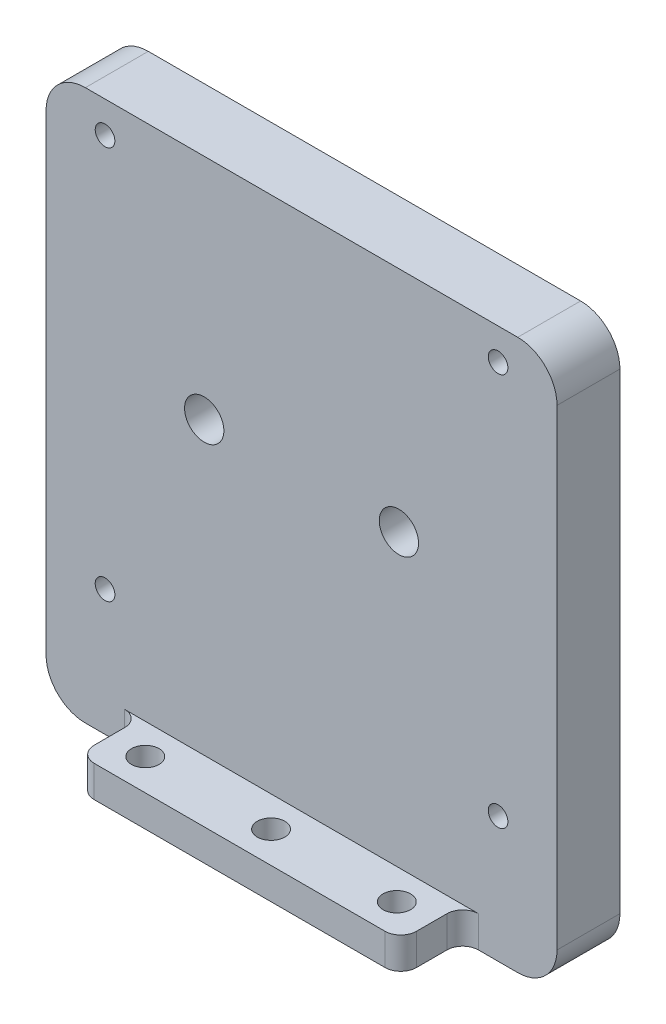
ISO-10303-21;
HEADER;
FILE_DESCRIPTION(('STEP AP214'),'2;1');
FILE_NAME('part.step','',(''),(''),'','','');
FILE_SCHEMA(('AUTOMOTIVE_DESIGN { 1 0 10303 214 1 1 1 1 }'));
ENDSEC;
DATA;
#1=APPLICATION_CONTEXT('core data for automotive mechanical design processes');
#2=APPLICATION_PROTOCOL_DEFINITION('international standard','automotive_design',2000,#1);
#3=PRODUCT_CONTEXT('',#1,'mechanical');
#4=PRODUCT('Part','Part','',(#3));
#5=PRODUCT_RELATED_PRODUCT_CATEGORY('part','',(#4));
#6=PRODUCT_DEFINITION_FORMATION('','',#4);
#7=PRODUCT_DEFINITION_CONTEXT('part definition',#1,'design');
#8=PRODUCT_DEFINITION('design','',#6,#7);
#9=PRODUCT_DEFINITION_SHAPE('','',#8);
#10=(LENGTH_UNIT() NAMED_UNIT(*) SI_UNIT(.MILLI.,.METRE.));
#11=(NAMED_UNIT(*) PLANE_ANGLE_UNIT() SI_UNIT($,.RADIAN.));
#12=(NAMED_UNIT(*) SI_UNIT($,.STERADIAN.) SOLID_ANGLE_UNIT());
#13=UNCERTAINTY_MEASURE_WITH_UNIT(LENGTH_MEASURE(1.E-05),#10,'distance_accuracy_value','');
#14=(GEOMETRIC_REPRESENTATION_CONTEXT(3) GLOBAL_UNCERTAINTY_ASSIGNED_CONTEXT((#13)) GLOBAL_UNIT_ASSIGNED_CONTEXT((#10,
#11,#12)) REPRESENTATION_CONTEXT('',''));
#15=CARTESIAN_POINT('',(0.,0.,0.));
#16=DIRECTION('',(0.,0.,1.));
#17=DIRECTION('',(1.,0.,0.));
#18=AXIS2_PLACEMENT_3D('',#15,#16,#17);
#19=CARTESIAN_POINT('',(0.,0.,0.));
#20=DIRECTION('',(0.,0.,1.));
#21=DIRECTION('',(1.,0.,0.));
#22=AXIS2_PLACEMENT_3D('',#19,#20,#21);
#23=PLANE('',#22);
#24=CARTESIAN_POINT('',(12.3825,6.00000000000001,0.));
#25=DIRECTION('',(0.,0.,-1.));
#26=DIRECTION('',(-1.,0.,0.));
#27=AXIS2_PLACEMENT_3D('',#24,#25,#26);
#28=CIRCLE('',#27,2.5);
#29=CARTESIAN_POINT('',(9.8825,6.00000000000001,0.));
#30=VERTEX_POINT('',#29);
#31=EDGE_CURVE('E339',#30,#30,#28,.T.);
#32=ORIENTED_EDGE('',*,*,#31,.F.);
#33=EDGE_LOOP('',(#32));
#34=FACE_BOUND('',#33,.T.);
#35=CARTESIAN_POINT('',(-12.3825,6.00000000000001,0.));
#36=DIRECTION('',(0.,0.,-1.));
#37=DIRECTION('',(-1.,0.,0.));
#38=AXIS2_PLACEMENT_3D('',#35,#36,#37);
#39=CIRCLE('',#38,2.5);
#40=CARTESIAN_POINT('',(-14.8825,6.00000000000001,0.));
#41=VERTEX_POINT('',#40);
#42=EDGE_CURVE('E325',#41,#41,#39,.T.);
#43=ORIENTED_EDGE('',*,*,#42,.F.);
#44=EDGE_LOOP('',(#43));
#45=FACE_BOUND('',#44,.T.);
#46=CARTESIAN_POINT('',(25.,-19.,0.));
#47=DIRECTION('',(0.,0.,-1.));
#48=DIRECTION('',(-1.,0.,0.));
#49=AXIS2_PLACEMENT_3D('',#46,#47,#48);
#50=CIRCLE('',#49,1.25);
#51=CARTESIAN_POINT('',(23.75,-19.,0.));
#52=VERTEX_POINT('',#51);
#53=EDGE_CURVE('E324',#52,#52,#50,.T.);
#54=ORIENTED_EDGE('',*,*,#53,.F.);
#55=EDGE_LOOP('',(#54));
#56=FACE_BOUND('',#55,.T.);
#57=CARTESIAN_POINT('',(25.,31.,0.));
#58=DIRECTION('',(0.,0.,-1.));
#59=DIRECTION('',(-1.,0.,0.));
#60=AXIS2_PLACEMENT_3D('',#57,#58,#59);
#61=CIRCLE('',#60,1.25);
#62=CARTESIAN_POINT('',(23.75,31.,0.));
#63=VERTEX_POINT('',#62);
#64=EDGE_CURVE('E320',#63,#63,#61,.T.);
#65=ORIENTED_EDGE('',*,*,#64,.F.);
#66=EDGE_LOOP('',(#65));
#67=FACE_BOUND('',#66,.T.);
#68=CARTESIAN_POINT('',(-25.,31.,0.));
#69=DIRECTION('',(0.,0.,-1.));
#70=DIRECTION('',(-1.,0.,0.));
#71=AXIS2_PLACEMENT_3D('',#68,#69,#70);
#72=CIRCLE('',#71,1.25);
#73=CARTESIAN_POINT('',(-26.25,31.,0.));
#74=VERTEX_POINT('',#73);
#75=EDGE_CURVE('E316',#74,#74,#72,.T.);
#76=ORIENTED_EDGE('',*,*,#75,.F.);
#77=EDGE_LOOP('',(#76));
#78=FACE_BOUND('',#77,.T.);
#79=DIRECTION('',(0.,1.,0.));
#80=VECTOR('',#79,1.);
#81=CARTESIAN_POINT('',(32.5,35.,0.));
#82=LINE('',#81,#80);
#83=CARTESIAN_POINT('',(32.5,-30.,0.));
#84=VERTEX_POINT('',#83);
#85=CARTESIAN_POINT('',(32.5,30.,0.));
#86=VERTEX_POINT('',#85);
#87=EDGE_CURVE('E178',#84,#86,#82,.T.);
#88=ORIENTED_EDGE('',*,*,#87,.F.);
#89=CARTESIAN_POINT('',(27.5,-30.,0.));
#90=DIRECTION('',(0.,0.,1.));
#91=DIRECTION('',(1.,0.,0.));
#92=AXIS2_PLACEMENT_3D('',#89,#90,#91);
#93=CIRCLE('',#92,5.);
#94=CARTESIAN_POINT('',(27.5,-35.,0.));
#95=VERTEX_POINT('',#94);
#96=EDGE_CURVE('E159',#84,#95,#93,.F.);
#97=ORIENTED_EDGE('',*,*,#96,.T.);
#98=DIRECTION('',(1.,0.,0.));
#99=VECTOR('',#98,1.);
#100=CARTESIAN_POINT('',(-32.5,-35.,0.));
#101=LINE('',#100,#99);
#102=CARTESIAN_POINT('',(-27.5,-35.,0.));
#103=VERTEX_POINT('',#102);
#104=EDGE_CURVE('E207',#103,#95,#101,.T.);
#105=ORIENTED_EDGE('',*,*,#104,.F.);
#106=CARTESIAN_POINT('',(-27.5,-30.,0.));
#107=DIRECTION('',(0.,0.,1.));
#108=DIRECTION('',(1.,0.,0.));
#109=AXIS2_PLACEMENT_3D('',#106,#107,#108);
#110=CIRCLE('',#109,5.);
#111=CARTESIAN_POINT('',(-32.5,-30.,0.));
#112=VERTEX_POINT('',#111);
#113=EDGE_CURVE('E172',#103,#112,#110,.F.);
#114=ORIENTED_EDGE('',*,*,#113,.T.);
#115=DIRECTION('',(0.,-1.,0.));
#116=VECTOR('',#115,1.);
#117=CARTESIAN_POINT('',(-32.5,35.,0.));
#118=LINE('',#117,#116);
#119=CARTESIAN_POINT('',(-32.5,30.,0.));
#120=VERTEX_POINT('',#119);
#121=EDGE_CURVE('E196',#120,#112,#118,.T.);
#122=ORIENTED_EDGE('',*,*,#121,.F.);
#123=CARTESIAN_POINT('',(-27.5,30.,0.));
#124=DIRECTION('',(0.,0.,1.));
#125=DIRECTION('',(1.,0.,0.));
#126=AXIS2_PLACEMENT_3D('',#123,#124,#125);
#127=CIRCLE('',#126,5.);
#128=CARTESIAN_POINT('',(-27.5,35.,0.));
#129=VERTEX_POINT('',#128);
#130=EDGE_CURVE('E183',#120,#129,#127,.F.);
#131=ORIENTED_EDGE('',*,*,#130,.T.);
#132=DIRECTION('',(-1.,0.,0.));
#133=VECTOR('',#132,1.);
#134=CARTESIAN_POINT('',(-32.5,35.,0.));
#135=LINE('',#134,#133);
#136=CARTESIAN_POINT('',(27.5,35.,0.));
#137=VERTEX_POINT('',#136);
#138=EDGE_CURVE('E190',#137,#129,#135,.T.);
#139=ORIENTED_EDGE('',*,*,#138,.F.);
#140=CARTESIAN_POINT('',(27.5,30.,0.));
#141=DIRECTION('',(0.,0.,1.));
#142=DIRECTION('',(1.,0.,0.));
#143=AXIS2_PLACEMENT_3D('',#140,#141,#142);
#144=CIRCLE('',#143,5.);
#145=EDGE_CURVE('E188',#137,#86,#144,.F.);
#146=ORIENTED_EDGE('',*,*,#145,.T.);
#147=EDGE_LOOP('',(#88,#97,#105,#114,#122,#131,#139,#146));
#148=FACE_BOUND('',#147,.T.);
#149=CARTESIAN_POINT('',(-25.,-19.,0.));
#150=DIRECTION('',(0.,0.,-1.));
#151=DIRECTION('',(-1.,0.,0.));
#152=AXIS2_PLACEMENT_3D('',#149,#150,#151);
#153=CIRCLE('',#152,1.25);
#154=CARTESIAN_POINT('',(-26.25,-19.,0.));
#155=VERTEX_POINT('',#154);
#156=EDGE_CURVE('E315',#155,#155,#153,.T.);
#157=ORIENTED_EDGE('',*,*,#156,.F.);
#158=EDGE_LOOP('',(#157));
#159=FACE_BOUND('',#158,.T.);
#160=ADVANCED_FACE('F43',(#34,#45,#56,#67,#78,#148,#159),#23,.F.);
#161=CARTESIAN_POINT('',(32.5,35.,8.));
#162=DIRECTION('',(-1.,0.,0.));
#163=DIRECTION('',(0.,-1.,0.));
#164=AXIS2_PLACEMENT_3D('',#161,#162,#163);
#165=PLANE('',#164);
#166=DIRECTION('',(0.,1.,0.));
#167=VECTOR('',#166,1.);
#168=CARTESIAN_POINT('',(32.5,35.,8.));
#169=LINE('',#168,#167);
#170=CARTESIAN_POINT('',(32.5,-30.,8.));
#171=VERTEX_POINT('',#170);
#172=CARTESIAN_POINT('',(32.5,30.,8.));
#173=VERTEX_POINT('',#172);
#174=EDGE_CURVE('E181',#171,#173,#169,.T.);
#175=ORIENTED_EDGE('',*,*,#174,.F.);
#176=DIRECTION('',(0.,0.,-1.));
#177=VECTOR('',#176,1.);
#178=CARTESIAN_POINT('',(32.5,-30.,8.));
#179=LINE('',#178,#177);
#180=EDGE_CURVE('E163',#171,#84,#179,.T.);
#181=ORIENTED_EDGE('',*,*,#180,.T.);
#182=ORIENTED_EDGE('',*,*,#87,.T.);
#183=DIRECTION('',(0.,0.,-1.));
#184=VECTOR('',#183,1.);
#185=CARTESIAN_POINT('',(32.5,30.,8.));
#186=LINE('',#185,#184);
#187=EDGE_CURVE('E184',#86,#173,#186,.F.);
#188=ORIENTED_EDGE('',*,*,#187,.T.);
#189=EDGE_LOOP('',(#175,#181,#182,#188));
#190=FACE_BOUND('',#189,.T.);
#191=ADVANCED_FACE('F177',(#190),#165,.F.);
#192=CARTESIAN_POINT('',(-32.5,35.,8.));
#193=DIRECTION('',(0.,-1.,0.));
#194=DIRECTION('',(0.,0.,-1.));
#195=AXIS2_PLACEMENT_3D('',#192,#193,#194);
#196=PLANE('',#195);
#197=DIRECTION('',(-1.,0.,0.));
#198=VECTOR('',#197,1.);
#199=CARTESIAN_POINT('',(-32.5,35.,8.));
#200=LINE('',#199,#198);
#201=CARTESIAN_POINT('',(27.5,35.,8.));
#202=VERTEX_POINT('',#201);
#203=CARTESIAN_POINT('',(-27.5,35.,8.));
#204=VERTEX_POINT('',#203);
#205=EDGE_CURVE('E392',#202,#204,#200,.T.);
#206=ORIENTED_EDGE('',*,*,#205,.F.);
#207=DIRECTION('',(0.,0.,-1.));
#208=VECTOR('',#207,1.);
#209=CARTESIAN_POINT('',(27.5,35.,8.));
#210=LINE('',#209,#208);
#211=EDGE_CURVE('E245',#202,#137,#210,.T.);
#212=ORIENTED_EDGE('',*,*,#211,.T.);
#213=ORIENTED_EDGE('',*,*,#138,.T.);
#214=DIRECTION('',(0.,0.,-1.));
#215=VECTOR('',#214,1.);
#216=CARTESIAN_POINT('',(-27.5,35.,8.));
#217=LINE('',#216,#215);
#218=EDGE_CURVE('E242',#129,#204,#217,.F.);
#219=ORIENTED_EDGE('',*,*,#218,.T.);
#220=EDGE_LOOP('',(#206,#212,#213,#219));
#221=FACE_BOUND('',#220,.T.);
#222=ADVANCED_FACE('F444',(#221),#196,.F.);
#223=CARTESIAN_POINT('',(-32.5,35.,8.));
#224=DIRECTION('',(1.,0.,0.));
#225=DIRECTION('',(0.,1.,0.));
#226=AXIS2_PLACEMENT_3D('',#223,#224,#225);
#227=PLANE('',#226);
#228=ORIENTED_EDGE('',*,*,#121,.T.);
#229=DIRECTION('',(0.,0.,-1.));
#230=VECTOR('',#229,1.);
#231=CARTESIAN_POINT('',(-32.5,-30.,8.));
#232=LINE('',#231,#230);
#233=CARTESIAN_POINT('',(-32.5,-30.,8.));
#234=VERTEX_POINT('',#233);
#235=EDGE_CURVE('E239',#112,#234,#232,.F.);
#236=ORIENTED_EDGE('',*,*,#235,.T.);
#237=DIRECTION('',(0.,-1.,0.));
#238=VECTOR('',#237,1.);
#239=CARTESIAN_POINT('',(-32.5,35.,8.));
#240=LINE('',#239,#238);
#241=CARTESIAN_POINT('',(-32.5,30.,8.));
#242=VERTEX_POINT('',#241);
#243=EDGE_CURVE('E395',#242,#234,#240,.T.);
#244=ORIENTED_EDGE('',*,*,#243,.F.);
#245=DIRECTION('',(0.,0.,-1.));
#246=VECTOR('',#245,1.);
#247=CARTESIAN_POINT('',(-32.5,30.,8.));
#248=LINE('',#247,#246);
#249=EDGE_CURVE('E235',#242,#120,#248,.T.);
#250=ORIENTED_EDGE('',*,*,#249,.T.);
#251=EDGE_LOOP('',(#228,#236,#244,#250));
#252=FACE_BOUND('',#251,.T.);
#253=ADVANCED_FACE('F452',(#252),#227,.F.);
#254=CARTESIAN_POINT('',(-32.5,-35.,8.));
#255=DIRECTION('',(0.,1.,0.));
#256=DIRECTION('',(0.,0.,1.));
#257=AXIS2_PLACEMENT_3D('',#254,#255,#256);
#258=PLANE('',#257);
#259=CARTESIAN_POINT('',(16.,-35.,11.8798952798945));
#260=DIRECTION('',(0.,-1.,0.));
#261=DIRECTION('',(0.,0.,-1.));
#262=AXIS2_PLACEMENT_3D('',#259,#260,#261);
#263=CIRCLE('',#262,1.75);
#264=CARTESIAN_POINT('',(16.,-35.,10.1298952798945));
#265=VERTEX_POINT('',#264);
#266=EDGE_CURVE('E358',#265,#265,#263,.T.);
#267=ORIENTED_EDGE('',*,*,#266,.F.);
#268=EDGE_LOOP('',(#267));
#269=FACE_BOUND('',#268,.T.);
#270=CARTESIAN_POINT('',(-16.,-35.,11.8798952798945));
#271=DIRECTION('',(0.,-1.,0.));
#272=DIRECTION('',(0.,0.,-1.));
#273=AXIS2_PLACEMENT_3D('',#270,#271,#272);
#274=CIRCLE('',#273,1.75);
#275=CARTESIAN_POINT('',(-16.,-35.,10.1298952798945));
#276=VERTEX_POINT('',#275);
#277=EDGE_CURVE('E359',#276,#276,#274,.T.);
#278=ORIENTED_EDGE('',*,*,#277,.F.);
#279=EDGE_LOOP('',(#278));
#280=FACE_BOUND('',#279,.T.);
#281=CARTESIAN_POINT('',(0.,-35.,11.8798952798945));
#282=DIRECTION('',(0.,-1.,0.));
#283=DIRECTION('',(0.,0.,-1.));
#284=AXIS2_PLACEMENT_3D('',#281,#282,#283);
#285=CIRCLE('',#284,1.75);
#286=CARTESIAN_POINT('',(0.,-35.,10.1298952798945));
#287=VERTEX_POINT('',#286);
#288=EDGE_CURVE('E302',#287,#287,#285,.T.);
#289=ORIENTED_EDGE('',*,*,#288,.F.);
#290=EDGE_LOOP('',(#289));
#291=FACE_BOUND('',#290,.T.);
#292=DIRECTION('',(0.,0.,-1.));
#293=VECTOR('',#292,1.);
#294=CARTESIAN_POINT('',(20.5,-35.,15.8798952798945));
#295=LINE('',#294,#293);
#296=CARTESIAN_POINT('',(20.5,-35.,13.8798952798945));
#297=VERTEX_POINT('',#296);
#298=CARTESIAN_POINT('',(20.5,-35.,10.));
#299=VERTEX_POINT('',#298);
#300=EDGE_CURVE('E198',#297,#299,#295,.T.);
#301=ORIENTED_EDGE('',*,*,#300,.F.);
#302=CARTESIAN_POINT('',(18.5,-35.,13.8798952798945));
#303=DIRECTION('',(0.,1.,0.));
#304=DIRECTION('',(0.,0.,1.));
#305=AXIS2_PLACEMENT_3D('',#302,#303,#304);
#306=CIRCLE('',#305,2.);
#307=CARTESIAN_POINT('',(18.5,-35.,15.8798952798945));
#308=VERTEX_POINT('',#307);
#309=EDGE_CURVE('E279',#297,#308,#306,.F.);
#310=ORIENTED_EDGE('',*,*,#309,.T.);
#311=DIRECTION('',(1.,0.,0.));
#312=VECTOR('',#311,1.);
#313=CARTESIAN_POINT('',(-20.5,-35.,15.8798952798945));
#314=LINE('',#313,#312);
#315=CARTESIAN_POINT('',(-18.5,-35.,15.8798952798945));
#316=VERTEX_POINT('',#315);
#317=EDGE_CURVE('E369',#316,#308,#314,.T.);
#318=ORIENTED_EDGE('',*,*,#317,.F.);
#319=CARTESIAN_POINT('',(-18.5,-35.,13.8798952798945));
#320=DIRECTION('',(0.,1.,0.));
#321=DIRECTION('',(0.,0.,1.));
#322=AXIS2_PLACEMENT_3D('',#319,#320,#321);
#323=CIRCLE('',#322,2.);
#324=CARTESIAN_POINT('',(-20.5,-35.,13.8798952798945));
#325=VERTEX_POINT('',#324);
#326=EDGE_CURVE('E68',#316,#325,#323,.F.);
#327=ORIENTED_EDGE('',*,*,#326,.T.);
#328=DIRECTION('',(0.,0.,-1.));
#329=VECTOR('',#328,1.);
#330=CARTESIAN_POINT('',(-20.5,-35.,15.8798952798945));
#331=LINE('',#330,#329);
#332=CARTESIAN_POINT('',(-20.5,-35.,10.));
#333=VERTEX_POINT('',#332);
#334=EDGE_CURVE('E191',#325,#333,#331,.T.);
#335=ORIENTED_EDGE('',*,*,#334,.T.);
#336=CARTESIAN_POINT('',(-22.5,-35.,10.));
#337=DIRECTION('',(0.,1.,0.));
#338=DIRECTION('',(0.,0.,1.));
#339=AXIS2_PLACEMENT_3D('',#336,#337,#338);
#340=CIRCLE('',#339,2.);
#341=CARTESIAN_POINT('',(-22.5,-35.,8.));
#342=VERTEX_POINT('',#341);
#343=EDGE_CURVE('E53',#333,#342,#340,.T.);
#344=ORIENTED_EDGE('',*,*,#343,.T.);
#345=DIRECTION('',(1.,0.,0.));
#346=VECTOR('',#345,1.);
#347=CARTESIAN_POINT('',(-32.5,-35.,8.));
#348=LINE('',#347,#346);
#349=CARTESIAN_POINT('',(-27.5,-35.,8.));
#350=VERTEX_POINT('',#349);
#351=EDGE_CURVE('E201',#350,#342,#348,.T.);
#352=ORIENTED_EDGE('',*,*,#351,.F.);
#353=DIRECTION('',(0.,0.,-1.));
#354=VECTOR('',#353,1.);
#355=CARTESIAN_POINT('',(-27.5,-35.,8.));
#356=LINE('',#355,#354);
#357=EDGE_CURVE('E171',#350,#103,#356,.T.);
#358=ORIENTED_EDGE('',*,*,#357,.T.);
#359=ORIENTED_EDGE('',*,*,#104,.T.);
#360=DIRECTION('',(0.,0.,-1.));
#361=VECTOR('',#360,1.);
#362=CARTESIAN_POINT('',(27.5,-35.,8.));
#363=LINE('',#362,#361);
#364=CARTESIAN_POINT('',(27.5,-35.,8.));
#365=VERTEX_POINT('',#364);
#366=EDGE_CURVE('E165',#95,#365,#363,.F.);
#367=ORIENTED_EDGE('',*,*,#366,.T.);
#368=CARTESIAN_POINT('',(22.5,-35.,8.));
#369=VERTEX_POINT('',#368);
#370=EDGE_CURVE('E398',#369,#365,#348,.T.);
#371=ORIENTED_EDGE('',*,*,#370,.F.);
#372=CARTESIAN_POINT('',(22.5,-35.,10.));
#373=DIRECTION('',(0.,1.,0.));
#374=DIRECTION('',(0.,0.,1.));
#375=AXIS2_PLACEMENT_3D('',#372,#373,#374);
#376=CIRCLE('',#375,2.);
#377=EDGE_CURVE('E292',#369,#299,#376,.T.);
#378=ORIENTED_EDGE('',*,*,#377,.T.);
#379=EDGE_LOOP('',(#301,#310,#318,#327,#335,#344,#352,#358,#359,#367,#371,#378));
#380=FACE_BOUND('',#379,.T.);
#381=ADVANCED_FACE('F437',(#269,#280,#291,#380),#258,.F.);
#382=CARTESIAN_POINT('',(0.,0.,8.));
#383=DIRECTION('',(0.,0.,1.));
#384=DIRECTION('',(1.,0.,0.));
#385=AXIS2_PLACEMENT_3D('',#382,#383,#384);
#386=PLANE('',#385);
#387=CARTESIAN_POINT('',(12.3825,6.00000000000001,8.));
#388=DIRECTION('',(0.,0.,1.));
#389=DIRECTION('',(1.,0.,0.));
#390=AXIS2_PLACEMENT_3D('',#387,#388,#389);
#391=CIRCLE('',#390,2.5);
#392=CARTESIAN_POINT('',(14.8825,6.00000000000001,8.));
#393=VERTEX_POINT('',#392);
#394=EDGE_CURVE('E47',#393,#393,#391,.T.);
#395=ORIENTED_EDGE('',*,*,#394,.F.);
#396=EDGE_LOOP('',(#395));
#397=FACE_BOUND('',#396,.T.);
#398=CARTESIAN_POINT('',(-12.3825,6.00000000000001,8.));
#399=DIRECTION('',(0.,0.,1.));
#400=DIRECTION('',(1.,0.,0.));
#401=AXIS2_PLACEMENT_3D('',#398,#399,#400);
#402=CIRCLE('',#401,2.5);
#403=CARTESIAN_POINT('',(-9.8825,6.00000000000001,8.));
#404=VERTEX_POINT('',#403);
#405=EDGE_CURVE('E321',#404,#404,#402,.T.);
#406=ORIENTED_EDGE('',*,*,#405,.F.);
#407=EDGE_LOOP('',(#406));
#408=FACE_BOUND('',#407,.T.);
#409=CARTESIAN_POINT('',(25.,-19.,8.));
#410=DIRECTION('',(0.,0.,1.));
#411=DIRECTION('',(1.,0.,0.));
#412=AXIS2_PLACEMENT_3D('',#409,#410,#411);
#413=CIRCLE('',#412,1.25);
#414=CARTESIAN_POINT('',(26.25,-19.,8.));
#415=VERTEX_POINT('',#414);
#416=EDGE_CURVE('E331',#415,#415,#413,.T.);
#417=ORIENTED_EDGE('',*,*,#416,.F.);
#418=EDGE_LOOP('',(#417));
#419=FACE_BOUND('',#418,.T.);
#420=CARTESIAN_POINT('',(25.,31.,8.));
#421=DIRECTION('',(0.,0.,1.));
#422=DIRECTION('',(1.,0.,0.));
#423=AXIS2_PLACEMENT_3D('',#420,#421,#422);
#424=CIRCLE('',#423,1.25);
#425=CARTESIAN_POINT('',(26.25,31.,8.));
#426=VERTEX_POINT('',#425);
#427=EDGE_CURVE('E317',#426,#426,#424,.T.);
#428=ORIENTED_EDGE('',*,*,#427,.F.);
#429=EDGE_LOOP('',(#428));
#430=FACE_BOUND('',#429,.T.);
#431=CARTESIAN_POINT('',(-25.,31.,8.));
#432=DIRECTION('',(0.,0.,1.));
#433=DIRECTION('',(1.,0.,0.));
#434=AXIS2_PLACEMENT_3D('',#431,#432,#433);
#435=CIRCLE('',#434,1.25);
#436=CARTESIAN_POINT('',(-23.75,31.,8.));
#437=VERTEX_POINT('',#436);
#438=EDGE_CURVE('E311',#437,#437,#435,.T.);
#439=ORIENTED_EDGE('',*,*,#438,.F.);
#440=EDGE_LOOP('',(#439));
#441=FACE_BOUND('',#440,.T.);
#442=CARTESIAN_POINT('',(-25.,-19.,8.));
#443=DIRECTION('',(0.,0.,1.));
#444=DIRECTION('',(1.,0.,0.));
#445=AXIS2_PLACEMENT_3D('',#442,#443,#444);
#446=CIRCLE('',#445,1.25);
#447=CARTESIAN_POINT('',(-23.75,-19.,8.));
#448=VERTEX_POINT('',#447);
#449=EDGE_CURVE('E354',#448,#448,#446,.T.);
#450=ORIENTED_EDGE('',*,*,#449,.F.);
#451=EDGE_LOOP('',(#450));
#452=FACE_BOUND('',#451,.T.);
#453=DIRECTION('',(-1.,0.,0.));
#454=VECTOR('',#453,1.);
#455=CARTESIAN_POINT('',(-20.5,-31.,8.));
#456=LINE('',#455,#454);
#457=CARTESIAN_POINT('',(22.5,-31.,8.));
#458=VERTEX_POINT('',#457);
#459=CARTESIAN_POINT('',(-22.5,-31.,8.));
#460=VERTEX_POINT('',#459);
#461=EDGE_CURVE('E310',#458,#460,#456,.T.);
#462=ORIENTED_EDGE('',*,*,#461,.F.);
#463=DIRECTION('',(0.,1.,0.));
#464=VECTOR('',#463,1.);
#465=CARTESIAN_POINT('',(22.4999999999995,3.12250225675819E-13,8.));
#466=LINE('',#465,#464);
#467=EDGE_CURVE('E260',#458,#369,#466,.F.);
#468=ORIENTED_EDGE('',*,*,#467,.T.);
#469=ORIENTED_EDGE('',*,*,#370,.T.);
#470=CARTESIAN_POINT('',(27.5,-30.,8.));
#471=DIRECTION('',(0.,0.,1.));
#472=DIRECTION('',(1.,0.,0.));
#473=AXIS2_PLACEMENT_3D('',#470,#471,#472);
#474=CIRCLE('',#473,5.);
#475=EDGE_CURVE('E232',#365,#171,#474,.T.);
#476=ORIENTED_EDGE('',*,*,#475,.T.);
#477=ORIENTED_EDGE('',*,*,#174,.T.);
#478=CARTESIAN_POINT('',(27.5,30.,8.));
#479=DIRECTION('',(0.,0.,1.));
#480=DIRECTION('',(1.,0.,0.));
#481=AXIS2_PLACEMENT_3D('',#478,#479,#480);
#482=CIRCLE('',#481,5.);
#483=EDGE_CURVE('E226',#173,#202,#482,.T.);
#484=ORIENTED_EDGE('',*,*,#483,.T.);
#485=ORIENTED_EDGE('',*,*,#205,.T.);
#486=CARTESIAN_POINT('',(-27.5,30.,8.));
#487=DIRECTION('',(0.,0.,1.));
#488=DIRECTION('',(1.,0.,0.));
#489=AXIS2_PLACEMENT_3D('',#486,#487,#488);
#490=CIRCLE('',#489,5.);
#491=EDGE_CURVE('E223',#204,#242,#490,.T.);
#492=ORIENTED_EDGE('',*,*,#491,.T.);
#493=ORIENTED_EDGE('',*,*,#243,.T.);
#494=CARTESIAN_POINT('',(-27.5,-30.,8.));
#495=DIRECTION('',(0.,0.,1.));
#496=DIRECTION('',(1.,0.,0.));
#497=AXIS2_PLACEMENT_3D('',#494,#495,#496);
#498=CIRCLE('',#497,5.);
#499=EDGE_CURVE('E229',#234,#350,#498,.T.);
#500=ORIENTED_EDGE('',*,*,#499,.T.);
#501=ORIENTED_EDGE('',*,*,#351,.T.);
#502=DIRECTION('',(0.,-1.,0.));
#503=VECTOR('',#502,1.);
#504=CARTESIAN_POINT('',(-22.5,0.,8.));
#505=LINE('',#504,#503);
#506=EDGE_CURVE('E256',#342,#460,#505,.F.);
#507=ORIENTED_EDGE('',*,*,#506,.T.);
#508=EDGE_LOOP('',(#462,#468,#469,#476,#477,#484,#485,#492,#493,#500,#501,#507));
#509=FACE_BOUND('',#508,.T.);
#510=ADVANCED_FACE('F407',(#397,#408,#419,#430,#441,#452,#509),#386,.T.);
#511=CARTESIAN_POINT('',(27.5,-30.,8.));
#512=DIRECTION('',(0.,0.,-1.));
#513=DIRECTION('',(-1.,0.,0.));
#514=AXIS2_PLACEMENT_3D('',#511,#512,#513);
#515=CYLINDRICAL_SURFACE('',#514,5.);
#516=ORIENTED_EDGE('',*,*,#475,.F.);
#517=ORIENTED_EDGE('',*,*,#366,.F.);
#518=ORIENTED_EDGE('',*,*,#96,.F.);
#519=ORIENTED_EDGE('',*,*,#180,.F.);
#520=EDGE_LOOP('',(#516,#517,#518,#519));
#521=FACE_BOUND('',#520,.T.);
#522=ADVANCED_FACE('F162',(#521),#515,.T.);
#523=CARTESIAN_POINT('',(-27.5,-30.,8.));
#524=DIRECTION('',(0.,0.,-1.));
#525=DIRECTION('',(-1.,0.,0.));
#526=AXIS2_PLACEMENT_3D('',#523,#524,#525);
#527=CYLINDRICAL_SURFACE('',#526,5.);
#528=ORIENTED_EDGE('',*,*,#499,.F.);
#529=ORIENTED_EDGE('',*,*,#235,.F.);
#530=ORIENTED_EDGE('',*,*,#113,.F.);
#531=ORIENTED_EDGE('',*,*,#357,.F.);
#532=EDGE_LOOP('',(#528,#529,#530,#531));
#533=FACE_BOUND('',#532,.T.);
#534=ADVANCED_FACE('F455',(#533),#527,.T.);
#535=CARTESIAN_POINT('',(27.5,30.,8.));
#536=DIRECTION('',(0.,0.,-1.));
#537=DIRECTION('',(-1.,0.,0.));
#538=AXIS2_PLACEMENT_3D('',#535,#536,#537);
#539=CYLINDRICAL_SURFACE('',#538,5.);
#540=ORIENTED_EDGE('',*,*,#483,.F.);
#541=ORIENTED_EDGE('',*,*,#187,.F.);
#542=ORIENTED_EDGE('',*,*,#145,.F.);
#543=ORIENTED_EDGE('',*,*,#211,.F.);
#544=EDGE_LOOP('',(#540,#541,#542,#543));
#545=FACE_BOUND('',#544,.T.);
#546=ADVANCED_FACE('F442',(#545),#539,.T.);
#547=CARTESIAN_POINT('',(-27.5,30.,8.));
#548=DIRECTION('',(0.,0.,-1.));
#549=DIRECTION('',(-1.,0.,0.));
#550=AXIS2_PLACEMENT_3D('',#547,#548,#549);
#551=CYLINDRICAL_SURFACE('',#550,5.);
#552=ORIENTED_EDGE('',*,*,#491,.F.);
#553=ORIENTED_EDGE('',*,*,#218,.F.);
#554=ORIENTED_EDGE('',*,*,#130,.F.);
#555=ORIENTED_EDGE('',*,*,#249,.F.);
#556=EDGE_LOOP('',(#552,#553,#554,#555));
#557=FACE_BOUND('',#556,.T.);
#558=ADVANCED_FACE('F450',(#557),#551,.T.);
#559=CARTESIAN_POINT('',(-20.5,-35.,15.8798952798945));
#560=DIRECTION('',(1.,0.,0.));
#561=DIRECTION('',(0.,0.,-1.));
#562=AXIS2_PLACEMENT_3D('',#559,#560,#561);
#563=PLANE('',#562);
#564=ORIENTED_EDGE('',*,*,#334,.F.);
#565=DIRECTION('',(0.,-1.,0.));
#566=VECTOR('',#565,1.);
#567=CARTESIAN_POINT('',(-20.5,-35.,13.8798952798945));
#568=LINE('',#567,#566);
#569=CARTESIAN_POINT('',(-20.5,-31.,13.8798952798945));
#570=VERTEX_POINT('',#569);
#571=EDGE_CURVE('E285',#325,#570,#568,.F.);
#572=ORIENTED_EDGE('',*,*,#571,.T.);
#573=DIRECTION('',(0.,0.,-1.));
#574=VECTOR('',#573,1.);
#575=CARTESIAN_POINT('',(-20.5,-31.,15.8798952798945));
#576=LINE('',#575,#574);
#577=CARTESIAN_POINT('',(-20.5,-31.,10.));
#578=VERTEX_POINT('',#577);
#579=EDGE_CURVE('E377',#570,#578,#576,.T.);
#580=ORIENTED_EDGE('',*,*,#579,.T.);
#581=DIRECTION('',(0.,-1.,0.));
#582=VECTOR('',#581,1.);
#583=CARTESIAN_POINT('',(-20.5,-35.,10.));
#584=LINE('',#583,#582);
#585=EDGE_CURVE('E282',#578,#333,#584,.T.);
#586=ORIENTED_EDGE('',*,*,#585,.T.);
#587=EDGE_LOOP('',(#564,#572,#580,#586));
#588=FACE_BOUND('',#587,.T.);
#589=ADVANCED_FACE('F416',(#588),#563,.F.);
#590=CARTESIAN_POINT('',(20.5,-35.,15.8798952798945));
#591=DIRECTION('',(-1.,0.,0.));
#592=DIRECTION('',(0.,-1.,0.));
#593=AXIS2_PLACEMENT_3D('',#590,#591,#592);
#594=PLANE('',#593);
#595=ORIENTED_EDGE('',*,*,#300,.T.);
#596=DIRECTION('',(0.,1.,0.));
#597=VECTOR('',#596,1.);
#598=CARTESIAN_POINT('',(20.5,-35.,10.));
#599=LINE('',#598,#597);
#600=CARTESIAN_POINT('',(20.5,-31.,10.));
#601=VERTEX_POINT('',#600);
#602=EDGE_CURVE('E252',#299,#601,#599,.T.);
#603=ORIENTED_EDGE('',*,*,#602,.T.);
#604=DIRECTION('',(0.,0.,-1.));
#605=VECTOR('',#604,1.);
#606=CARTESIAN_POINT('',(20.5,-31.,15.8798952798945));
#607=LINE('',#606,#605);
#608=CARTESIAN_POINT('',(20.5,-31.,13.8798952798945));
#609=VERTEX_POINT('',#608);
#610=EDGE_CURVE('E383',#609,#601,#607,.T.);
#611=ORIENTED_EDGE('',*,*,#610,.F.);
#612=DIRECTION('',(0.,1.,0.));
#613=VECTOR('',#612,1.);
#614=CARTESIAN_POINT('',(20.5,-35.,13.8798952798945));
#615=LINE('',#614,#613);
#616=EDGE_CURVE('E249',#609,#297,#615,.F.);
#617=ORIENTED_EDGE('',*,*,#616,.T.);
#618=EDGE_LOOP('',(#595,#603,#611,#617));
#619=FACE_BOUND('',#618,.T.);
#620=ADVANCED_FACE('F430',(#619),#594,.F.);
#621=CARTESIAN_POINT('',(-20.5,-31.,15.8798952798945));
#622=DIRECTION('',(0.,-1.,0.));
#623=DIRECTION('',(1.,0.,0.));
#624=AXIS2_PLACEMENT_3D('',#621,#622,#623);
#625=PLANE('',#624);
#626=CARTESIAN_POINT('',(16.,-31.,11.8798952798945));
#627=DIRECTION('',(0.,-1.,0.));
#628=DIRECTION('',(1.,0.,0.));
#629=AXIS2_PLACEMENT_3D('',#626,#627,#628);
#630=CIRCLE('',#629,1.75);
#631=CARTESIAN_POINT('',(17.75,-31.,11.8798952798945));
#632=VERTEX_POINT('',#631);
#633=EDGE_CURVE('E306',#632,#632,#630,.T.);
#634=ORIENTED_EDGE('',*,*,#633,.T.);
#635=EDGE_LOOP('',(#634));
#636=FACE_BOUND('',#635,.T.);
#637=CARTESIAN_POINT('',(-16.,-31.,11.8798952798945));
#638=DIRECTION('',(0.,-1.,0.));
#639=DIRECTION('',(1.,0.,0.));
#640=AXIS2_PLACEMENT_3D('',#637,#638,#639);
#641=CIRCLE('',#640,1.75);
#642=CARTESIAN_POINT('',(-14.25,-31.,11.8798952798945));
#643=VERTEX_POINT('',#642);
#644=EDGE_CURVE('E301',#643,#643,#641,.T.);
#645=ORIENTED_EDGE('',*,*,#644,.T.);
#646=EDGE_LOOP('',(#645));
#647=FACE_BOUND('',#646,.T.);
#648=CARTESIAN_POINT('',(0.,-31.,11.8798952798945));
#649=DIRECTION('',(0.,-1.,0.));
#650=DIRECTION('',(1.,0.,0.));
#651=AXIS2_PLACEMENT_3D('',#648,#649,#650);
#652=CIRCLE('',#651,1.75);
#653=CARTESIAN_POINT('',(1.75,-31.,11.8798952798945));
#654=VERTEX_POINT('',#653);
#655=EDGE_CURVE('E297',#654,#654,#652,.T.);
#656=ORIENTED_EDGE('',*,*,#655,.T.);
#657=EDGE_LOOP('',(#656));
#658=FACE_BOUND('',#657,.T.);
#659=DIRECTION('',(-1.,0.,0.));
#660=VECTOR('',#659,1.);
#661=CARTESIAN_POINT('',(-20.5,-31.,15.8798952798945));
#662=LINE('',#661,#660);
#663=CARTESIAN_POINT('',(18.5,-31.,15.8798952798945));
#664=VERTEX_POINT('',#663);
#665=CARTESIAN_POINT('',(-18.5,-31.,15.8798952798945));
#666=VERTEX_POINT('',#665);
#667=EDGE_CURVE('E373',#664,#666,#662,.T.);
#668=ORIENTED_EDGE('',*,*,#667,.F.);
#669=CARTESIAN_POINT('',(18.5,-31.,13.8798952798945));
#670=DIRECTION('',(0.,-1.,0.));
#671=DIRECTION('',(1.,0.,0.));
#672=AXIS2_PLACEMENT_3D('',#669,#670,#671);
#673=CIRCLE('',#672,2.);
#674=EDGE_CURVE('E274',#664,#609,#673,.F.);
#675=ORIENTED_EDGE('',*,*,#674,.T.);
#676=ORIENTED_EDGE('',*,*,#610,.T.);
#677=CARTESIAN_POINT('',(22.5,-31.,10.));
#678=DIRECTION('',(0.,-1.,0.));
#679=DIRECTION('',(1.,0.,0.));
#680=AXIS2_PLACEMENT_3D('',#677,#678,#679);
#681=CIRCLE('',#680,2.);
#682=EDGE_CURVE('E288',#601,#458,#681,.T.);
#683=ORIENTED_EDGE('',*,*,#682,.T.);
#684=ORIENTED_EDGE('',*,*,#461,.T.);
#685=CARTESIAN_POINT('',(-22.5,-31.,10.));
#686=DIRECTION('',(0.,-1.,0.));
#687=DIRECTION('',(1.,0.,0.));
#688=AXIS2_PLACEMENT_3D('',#685,#686,#687);
#689=CIRCLE('',#688,2.);
#690=EDGE_CURVE('E11',#460,#578,#689,.T.);
#691=ORIENTED_EDGE('',*,*,#690,.T.);
#692=ORIENTED_EDGE('',*,*,#579,.F.);
#693=CARTESIAN_POINT('',(-18.5,-31.,13.8798952798945));
#694=DIRECTION('',(0.,-1.,0.));
#695=DIRECTION('',(1.,0.,0.));
#696=AXIS2_PLACEMENT_3D('',#693,#694,#695);
#697=CIRCLE('',#696,2.);
#698=EDGE_CURVE('E271',#570,#666,#697,.F.);
#699=ORIENTED_EDGE('',*,*,#698,.T.);
#700=EDGE_LOOP('',(#668,#675,#676,#683,#684,#691,#692,#699));
#701=FACE_BOUND('',#700,.T.);
#702=ADVANCED_FACE('F413',(#636,#647,#658,#701),#625,.F.);
#703=CARTESIAN_POINT('',(0.,0.,15.8798952798945));
#704=DIRECTION('',(0.,0.,-1.));
#705=DIRECTION('',(-1.,0.,0.));
#706=AXIS2_PLACEMENT_3D('',#703,#704,#705);
#707=PLANE('',#706);
#708=ORIENTED_EDGE('',*,*,#317,.T.);
#709=DIRECTION('',(0.,1.,0.));
#710=VECTOR('',#709,1.);
#711=CARTESIAN_POINT('',(18.4999999999995,2.56739074444561E-13,15.8798952798945));
#712=LINE('',#711,#710);
#713=EDGE_CURVE('E267',#308,#664,#712,.T.);
#714=ORIENTED_EDGE('',*,*,#713,.T.);
#715=ORIENTED_EDGE('',*,*,#667,.T.);
#716=DIRECTION('',(0.,-1.,0.));
#717=VECTOR('',#716,1.);
#718=CARTESIAN_POINT('',(-18.5,0.,15.8798952798945));
#719=LINE('',#718,#717);
#720=EDGE_CURVE('E263',#666,#316,#719,.T.);
#721=ORIENTED_EDGE('',*,*,#720,.T.);
#722=EDGE_LOOP('',(#708,#714,#715,#721));
#723=FACE_BOUND('',#722,.T.);
#724=ADVANCED_FACE('F422',(#723),#707,.F.);
#725=CARTESIAN_POINT('',(22.5,-35.,10.));
#726=DIRECTION('',(0.,1.,0.));
#727=DIRECTION('',(-1.,0.,0.));
#728=AXIS2_PLACEMENT_3D('',#725,#726,#727);
#729=CYLINDRICAL_SURFACE('',#728,2.);
#730=ORIENTED_EDGE('',*,*,#377,.F.);
#731=ORIENTED_EDGE('',*,*,#467,.F.);
#732=ORIENTED_EDGE('',*,*,#682,.F.);
#733=ORIENTED_EDGE('',*,*,#602,.F.);
#734=EDGE_LOOP('',(#730,#731,#732,#733));
#735=FACE_BOUND('',#734,.T.);
#736=ADVANCED_FACE('F435',(#735),#729,.F.);
#737=CARTESIAN_POINT('',(18.4999999999995,2.56739074444561E-13,13.8798952798945));
#738=DIRECTION('',(0.,1.,0.));
#739=DIRECTION('',(-1.,0.,0.));
#740=AXIS2_PLACEMENT_3D('',#737,#738,#739);
#741=CYLINDRICAL_SURFACE('',#740,2.);
#742=ORIENTED_EDGE('',*,*,#309,.F.);
#743=ORIENTED_EDGE('',*,*,#616,.F.);
#744=ORIENTED_EDGE('',*,*,#674,.F.);
#745=ORIENTED_EDGE('',*,*,#713,.F.);
#746=EDGE_LOOP('',(#742,#743,#744,#745));
#747=FACE_BOUND('',#746,.T.);
#748=ADVANCED_FACE('F426',(#747),#741,.T.);
#749=CARTESIAN_POINT('',(-18.5,0.,13.8798952798945));
#750=DIRECTION('',(0.,-1.,0.));
#751=DIRECTION('',(0.,0.,-1.));
#752=AXIS2_PLACEMENT_3D('',#749,#750,#751);
#753=CYLINDRICAL_SURFACE('',#752,2.);
#754=ORIENTED_EDGE('',*,*,#698,.F.);
#755=ORIENTED_EDGE('',*,*,#571,.F.);
#756=ORIENTED_EDGE('',*,*,#326,.F.);
#757=ORIENTED_EDGE('',*,*,#720,.F.);
#758=EDGE_LOOP('',(#754,#755,#756,#757));
#759=FACE_BOUND('',#758,.T.);
#760=ADVANCED_FACE('F419',(#759),#753,.T.);
#761=CARTESIAN_POINT('',(-22.5,-35.,10.));
#762=DIRECTION('',(0.,-1.,0.));
#763=DIRECTION('',(0.,0.,-1.));
#764=AXIS2_PLACEMENT_3D('',#761,#762,#763);
#765=CYLINDRICAL_SURFACE('',#764,2.);
#766=ORIENTED_EDGE('',*,*,#690,.F.);
#767=ORIENTED_EDGE('',*,*,#506,.F.);
#768=ORIENTED_EDGE('',*,*,#343,.F.);
#769=ORIENTED_EDGE('',*,*,#585,.F.);
#770=EDGE_LOOP('',(#766,#767,#768,#769));
#771=FACE_BOUND('',#770,.T.);
#772=ADVANCED_FACE('F45',(#771),#765,.F.);
#773=CARTESIAN_POINT('',(0.,35.,11.8798952798945));
#774=DIRECTION('',(0.,-1.,0.));
#775=DIRECTION('',(0.,0.,-1.));
#776=AXIS2_PLACEMENT_3D('',#773,#774,#775);
#777=CYLINDRICAL_SURFACE('',#776,1.75);
#778=ORIENTED_EDGE('',*,*,#288,.T.);
#779=EDGE_LOOP('',(#778));
#780=FACE_BOUND('',#779,.T.);
#781=ORIENTED_EDGE('',*,*,#655,.F.);
#782=EDGE_LOOP('',(#781));
#783=FACE_BOUND('',#782,.T.);
#784=ADVANCED_FACE('F580',(#780,#783),#777,.F.);
#785=CARTESIAN_POINT('',(-16.,35.,11.8798952798945));
#786=DIRECTION('',(0.,-1.,0.));
#787=DIRECTION('',(0.,0.,-1.));
#788=AXIS2_PLACEMENT_3D('',#785,#786,#787);
#789=CYLINDRICAL_SURFACE('',#788,1.75);
#790=ORIENTED_EDGE('',*,*,#277,.T.);
#791=EDGE_LOOP('',(#790));
#792=FACE_BOUND('',#791,.T.);
#793=ORIENTED_EDGE('',*,*,#644,.F.);
#794=EDGE_LOOP('',(#793));
#795=FACE_BOUND('',#794,.T.);
#796=ADVANCED_FACE('F589',(#792,#795),#789,.F.);
#797=CARTESIAN_POINT('',(16.,35.,11.8798952798945));
#798=DIRECTION('',(0.,-1.,0.));
#799=DIRECTION('',(0.,0.,-1.));
#800=AXIS2_PLACEMENT_3D('',#797,#798,#799);
#801=CYLINDRICAL_SURFACE('',#800,1.75);
#802=ORIENTED_EDGE('',*,*,#266,.T.);
#803=EDGE_LOOP('',(#802));
#804=FACE_BOUND('',#803,.T.);
#805=ORIENTED_EDGE('',*,*,#633,.F.);
#806=EDGE_LOOP('',(#805));
#807=FACE_BOUND('',#806,.T.);
#808=ADVANCED_FACE('F596',(#804,#807),#801,.F.);
#809=CARTESIAN_POINT('',(-25.,-19.,0.));
#810=DIRECTION('',(0.,0.,-1.));
#811=DIRECTION('',(-1.,0.,0.));
#812=AXIS2_PLACEMENT_3D('',#809,#810,#811);
#813=CYLINDRICAL_SURFACE('',#812,1.25);
#814=ORIENTED_EDGE('',*,*,#449,.T.);
#815=EDGE_LOOP('',(#814));
#816=FACE_BOUND('',#815,.T.);
#817=ORIENTED_EDGE('',*,*,#156,.T.);
#818=EDGE_LOOP('',(#817));
#819=FACE_BOUND('',#818,.T.);
#820=ADVANCED_FACE('F604',(#816,#819),#813,.F.);
#821=CARTESIAN_POINT('',(-25.,31.,0.));
#822=DIRECTION('',(0.,0.,-1.));
#823=DIRECTION('',(-1.,0.,0.));
#824=AXIS2_PLACEMENT_3D('',#821,#822,#823);
#825=CYLINDRICAL_SURFACE('',#824,1.25);
#826=ORIENTED_EDGE('',*,*,#438,.T.);
#827=EDGE_LOOP('',(#826));
#828=FACE_BOUND('',#827,.T.);
#829=ORIENTED_EDGE('',*,*,#75,.T.);
#830=EDGE_LOOP('',(#829));
#831=FACE_BOUND('',#830,.T.);
#832=ADVANCED_FACE('F613',(#828,#831),#825,.F.);
#833=CARTESIAN_POINT('',(25.,31.,0.));
#834=DIRECTION('',(0.,0.,-1.));
#835=DIRECTION('',(-1.,0.,0.));
#836=AXIS2_PLACEMENT_3D('',#833,#834,#835);
#837=CYLINDRICAL_SURFACE('',#836,1.25);
#838=ORIENTED_EDGE('',*,*,#427,.T.);
#839=EDGE_LOOP('',(#838));
#840=FACE_BOUND('',#839,.T.);
#841=ORIENTED_EDGE('',*,*,#64,.T.);
#842=EDGE_LOOP('',(#841));
#843=FACE_BOUND('',#842,.T.);
#844=ADVANCED_FACE('F621',(#840,#843),#837,.F.);
#845=CARTESIAN_POINT('',(25.,-19.,0.));
#846=DIRECTION('',(0.,0.,-1.));
#847=DIRECTION('',(-1.,0.,0.));
#848=AXIS2_PLACEMENT_3D('',#845,#846,#847);
#849=CYLINDRICAL_SURFACE('',#848,1.25);
#850=ORIENTED_EDGE('',*,*,#416,.T.);
#851=EDGE_LOOP('',(#850));
#852=FACE_BOUND('',#851,.T.);
#853=ORIENTED_EDGE('',*,*,#53,.T.);
#854=EDGE_LOOP('',(#853));
#855=FACE_BOUND('',#854,.T.);
#856=ADVANCED_FACE('F629',(#852,#855),#849,.F.);
#857=CARTESIAN_POINT('',(-12.3825,6.00000000000001,0.));
#858=DIRECTION('',(0.,0.,-1.));
#859=DIRECTION('',(-1.,0.,0.));
#860=AXIS2_PLACEMENT_3D('',#857,#858,#859);
#861=CYLINDRICAL_SURFACE('',#860,2.5);
#862=ORIENTED_EDGE('',*,*,#405,.T.);
#863=EDGE_LOOP('',(#862));
#864=FACE_BOUND('',#863,.T.);
#865=ORIENTED_EDGE('',*,*,#42,.T.);
#866=EDGE_LOOP('',(#865));
#867=FACE_BOUND('',#866,.T.);
#868=ADVANCED_FACE('F637',(#864,#867),#861,.F.);
#869=CARTESIAN_POINT('',(12.3825,6.00000000000001,0.));
#870=DIRECTION('',(0.,0.,-1.));
#871=DIRECTION('',(-1.,0.,0.));
#872=AXIS2_PLACEMENT_3D('',#869,#870,#871);
#873=CYLINDRICAL_SURFACE('',#872,2.5);
#874=ORIENTED_EDGE('',*,*,#394,.T.);
#875=EDGE_LOOP('',(#874));
#876=FACE_BOUND('',#875,.T.);
#877=ORIENTED_EDGE('',*,*,#31,.T.);
#878=EDGE_LOOP('',(#877));
#879=FACE_BOUND('',#878,.T.);
#880=ADVANCED_FACE('F645',(#876,#879),#873,.F.);
#881=CLOSED_SHELL('',(#160,#191,#222,#253,#381,#510,#522,#534,#546,#558,#589,#620,#702,#724,
#736,#748,#760,#772,#784,#796,#808,#820,#832,#844,#856,#868,#880));
#882=MANIFOLD_SOLID_BREP('B2',#881);
#883=ADVANCED_BREP_SHAPE_REPRESENTATION('',(#18,#882),#14);
#884=SHAPE_DEFINITION_REPRESENTATION(#9,#883);
ENDSEC;
END-ISO-10303-21;
